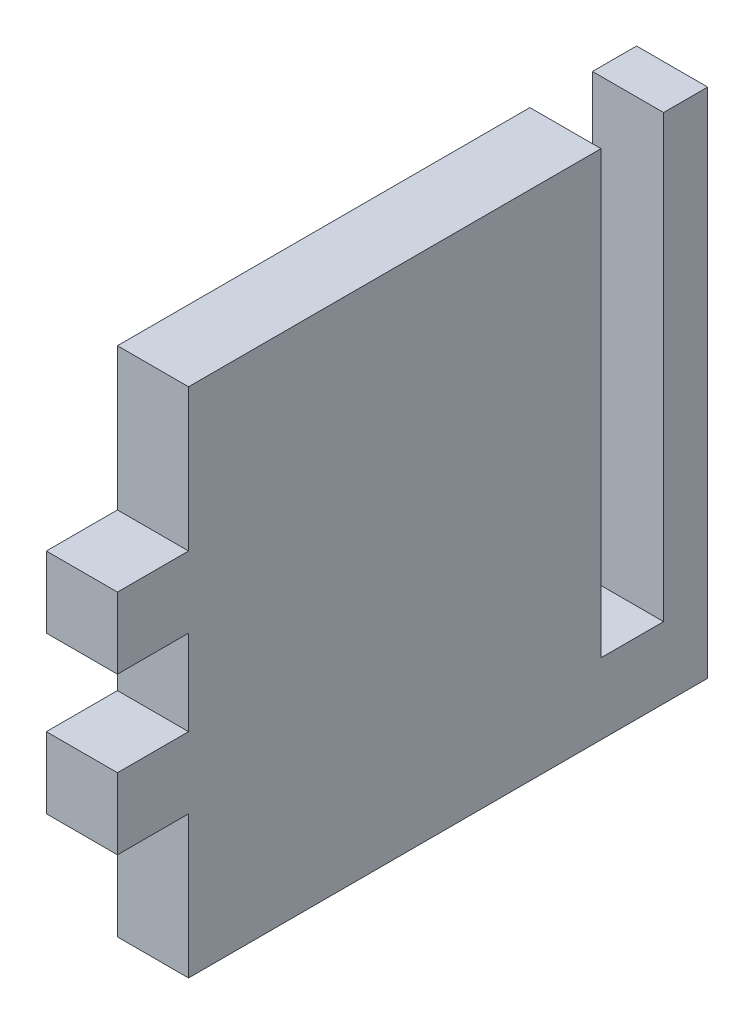
ISO-10303-21;
HEADER;
FILE_DESCRIPTION(('STEP AP214'),'2;1');
FILE_NAME('part.step','',(''),(''),'','','');
FILE_SCHEMA(('AUTOMOTIVE_DESIGN { 1 0 10303 214 1 1 1 1 }'));
ENDSEC;
DATA;
#1=APPLICATION_CONTEXT('core data for automotive mechanical design processes');
#2=APPLICATION_PROTOCOL_DEFINITION('international standard','automotive_design',2000,#1);
#3=PRODUCT_CONTEXT('',#1,'mechanical');
#4=PRODUCT('Part','Part','',(#3));
#5=PRODUCT_RELATED_PRODUCT_CATEGORY('part','',(#4));
#6=PRODUCT_DEFINITION_FORMATION('','',#4);
#7=PRODUCT_DEFINITION_CONTEXT('part definition',#1,'design');
#8=PRODUCT_DEFINITION('design','',#6,#7);
#9=PRODUCT_DEFINITION_SHAPE('','',#8);
#10=(LENGTH_UNIT() NAMED_UNIT(*) SI_UNIT(.MILLI.,.METRE.));
#11=(NAMED_UNIT(*) PLANE_ANGLE_UNIT() SI_UNIT($,.RADIAN.));
#12=(NAMED_UNIT(*) SI_UNIT($,.STERADIAN.) SOLID_ANGLE_UNIT());
#13=UNCERTAINTY_MEASURE_WITH_UNIT(LENGTH_MEASURE(1.E-05),#10,'distance_accuracy_value','');
#14=(GEOMETRIC_REPRESENTATION_CONTEXT(3) GLOBAL_UNCERTAINTY_ASSIGNED_CONTEXT((#13)) GLOBAL_UNIT_ASSIGNED_CONTEXT((#10,
#11,#12)) REPRESENTATION_CONTEXT('',''));
#15=CARTESIAN_POINT('',(0.,0.,0.));
#16=DIRECTION('',(0.,0.,1.));
#17=DIRECTION('',(1.,0.,0.));
#18=AXIS2_PLACEMENT_3D('',#15,#16,#17);
#19=CARTESIAN_POINT('',(6.35,45.72,0.));
#20=DIRECTION('',(0.,-1.,0.));
#21=DIRECTION('',(0.,0.,-1.));
#22=AXIS2_PLACEMENT_3D('',#19,#20,#21);
#23=PLANE('',#22);
#24=DIRECTION('',(0.,0.,1.));
#25=VECTOR('',#24,1.);
#26=CARTESIAN_POINT('',(6.35,45.72,0.));
#27=LINE('',#26,#25);
#28=CARTESIAN_POINT('',(6.35,45.72,-43.18));
#29=VERTEX_POINT('',#28);
#30=CARTESIAN_POINT('',(6.35,45.72,-6.35));
#31=VERTEX_POINT('',#30);
#32=EDGE_CURVE('E250',#29,#31,#27,.T.);
#33=ORIENTED_EDGE('',*,*,#32,.F.);
#34=DIRECTION('',(1.,0.,0.));
#35=VECTOR('',#34,1.);
#36=CARTESIAN_POINT('',(0.,45.72,-43.18));
#37=LINE('',#36,#35);
#38=CARTESIAN_POINT('',(0.,45.72,-43.18));
#39=VERTEX_POINT('',#38);
#40=EDGE_CURVE('E174',#39,#29,#37,.T.);
#41=ORIENTED_EDGE('',*,*,#40,.F.);
#42=DIRECTION('',(0.,0.,1.));
#43=VECTOR('',#42,1.);
#44=CARTESIAN_POINT('',(0.,45.72,0.));
#45=LINE('',#44,#43);
#46=CARTESIAN_POINT('',(0.,45.72,-6.35));
#47=VERTEX_POINT('',#46);
#48=EDGE_CURVE('E165',#39,#47,#45,.T.);
#49=ORIENTED_EDGE('',*,*,#48,.T.);
#50=DIRECTION('',(1.,0.,0.));
#51=VECTOR('',#50,1.);
#52=CARTESIAN_POINT('',(0.,45.72,-6.35));
#53=LINE('',#52,#51);
#54=EDGE_CURVE('E235',#47,#31,#53,.T.);
#55=ORIENTED_EDGE('',*,*,#54,.T.);
#56=EDGE_LOOP('',(#33,#41,#49,#55));
#57=FACE_BOUND('',#56,.T.);
#58=ADVANCED_FACE('F32',(#57),#23,.F.);
#59=CARTESIAN_POINT('',(6.35,0.,0.));
#60=DIRECTION('',(0.,0.,-1.));
#61=DIRECTION('',(-1.,0.,0.));
#62=AXIS2_PLACEMENT_3D('',#59,#60,#61);
#63=PLANE('',#62);
#64=DIRECTION('',(0.,-1.,0.));
#65=VECTOR('',#64,1.);
#66=CARTESIAN_POINT('',(0.,0.,0.));
#67=LINE('',#66,#65);
#68=CARTESIAN_POINT('',(0.,33.02,0.));
#69=VERTEX_POINT('',#68);
#70=CARTESIAN_POINT('',(0.,26.67,0.));
#71=VERTEX_POINT('',#70);
#72=EDGE_CURVE('E254',#69,#71,#67,.T.);
#73=ORIENTED_EDGE('',*,*,#72,.T.);
#74=DIRECTION('',(1.,0.,0.));
#75=VECTOR('',#74,1.);
#76=CARTESIAN_POINT('',(0.,26.67,0.));
#77=LINE('',#76,#75);
#78=CARTESIAN_POINT('',(6.35,26.67,0.));
#79=VERTEX_POINT('',#78);
#80=EDGE_CURVE('E196',#71,#79,#77,.T.);
#81=ORIENTED_EDGE('',*,*,#80,.T.);
#82=DIRECTION('',(0.,-1.,0.));
#83=VECTOR('',#82,1.);
#84=CARTESIAN_POINT('',(6.35,0.,0.));
#85=LINE('',#84,#83);
#86=CARTESIAN_POINT('',(6.35,33.02,0.));
#87=VERTEX_POINT('',#86);
#88=EDGE_CURVE('E242',#87,#79,#85,.T.);
#89=ORIENTED_EDGE('',*,*,#88,.F.);
#90=DIRECTION('',(1.,0.,0.));
#91=VECTOR('',#90,1.);
#92=CARTESIAN_POINT('',(0.,33.02,0.));
#93=LINE('',#92,#91);
#94=EDGE_CURVE('E230',#69,#87,#93,.T.);
#95=ORIENTED_EDGE('',*,*,#94,.F.);
#96=EDGE_LOOP('',(#73,#81,#89,#95));
#97=FACE_BOUND('',#96,.T.);
#98=ADVANCED_FACE('F305',(#97),#63,.F.);
#99=CARTESIAN_POINT('',(6.35,19.05,0.));
#100=VERTEX_POINT('',#99);
#101=CARTESIAN_POINT('',(6.35,12.7,0.));
#102=VERTEX_POINT('',#101);
#103=EDGE_CURVE('E246',#100,#102,#85,.T.);
#104=ORIENTED_EDGE('',*,*,#103,.F.);
#105=DIRECTION('',(1.,0.,0.));
#106=VECTOR('',#105,1.);
#107=CARTESIAN_POINT('',(0.,19.05,0.));
#108=LINE('',#107,#106);
#109=CARTESIAN_POINT('',(0.,19.05,0.));
#110=VERTEX_POINT('',#109);
#111=EDGE_CURVE('E189',#110,#100,#108,.T.);
#112=ORIENTED_EDGE('',*,*,#111,.F.);
#113=CARTESIAN_POINT('',(0.,12.7,0.));
#114=VERTEX_POINT('',#113);
#115=EDGE_CURVE('E238',#110,#114,#67,.T.);
#116=ORIENTED_EDGE('',*,*,#115,.T.);
#117=DIRECTION('',(1.,0.,0.));
#118=VECTOR('',#117,1.);
#119=CARTESIAN_POINT('',(0.,12.7,0.));
#120=LINE('',#119,#118);
#121=EDGE_CURVE('E217',#114,#102,#120,.T.);
#122=ORIENTED_EDGE('',*,*,#121,.T.);
#123=EDGE_LOOP('',(#104,#112,#116,#122));
#124=FACE_BOUND('',#123,.T.);
#125=ADVANCED_FACE('F34',(#124),#63,.F.);
#126=CARTESIAN_POINT('',(6.35,0.,0.));
#127=DIRECTION('',(0.,1.,0.));
#128=DIRECTION('',(0.,0.,1.));
#129=AXIS2_PLACEMENT_3D('',#126,#127,#128);
#130=PLANE('',#129);
#131=DIRECTION('',(0.,0.,-1.));
#132=VECTOR('',#131,1.);
#133=CARTESIAN_POINT('',(6.35,0.,0.));
#134=LINE('',#133,#132);
#135=CARTESIAN_POINT('',(6.35,0.,-6.35));
#136=VERTEX_POINT('',#135);
#137=CARTESIAN_POINT('',(6.35,0.,-52.705));
#138=VERTEX_POINT('',#137);
#139=EDGE_CURVE('E245',#136,#138,#134,.T.);
#140=ORIENTED_EDGE('',*,*,#139,.F.);
#141=DIRECTION('',(1.,0.,0.));
#142=VECTOR('',#141,1.);
#143=CARTESIAN_POINT('',(0.,0.,-6.35));
#144=LINE('',#143,#142);
#145=CARTESIAN_POINT('',(0.,0.,-6.35));
#146=VERTEX_POINT('',#145);
#147=EDGE_CURVE('E212',#146,#136,#144,.T.);
#148=ORIENTED_EDGE('',*,*,#147,.F.);
#149=DIRECTION('',(0.,0.,-1.));
#150=VECTOR('',#149,1.);
#151=CARTESIAN_POINT('',(0.,0.,0.));
#152=LINE('',#151,#150);
#153=CARTESIAN_POINT('',(0.,0.,-52.705));
#154=VERTEX_POINT('',#153);
#155=EDGE_CURVE('E257',#146,#154,#152,.T.);
#156=ORIENTED_EDGE('',*,*,#155,.T.);
#157=DIRECTION('',(-1.,0.,0.));
#158=VECTOR('',#157,1.);
#159=CARTESIAN_POINT('',(6.35,0.,-52.705));
#160=LINE('',#159,#158);
#161=EDGE_CURVE('E11',#138,#154,#160,.T.);
#162=ORIENTED_EDGE('',*,*,#161,.F.);
#163=EDGE_LOOP('',(#140,#148,#156,#162));
#164=FACE_BOUND('',#163,.T.);
#165=ADVANCED_FACE('F277',(#164),#130,.F.);
#166=CARTESIAN_POINT('',(6.35,0.,-52.705));
#167=DIRECTION('',(0.,0.,1.));
#168=DIRECTION('',(1.,0.,0.));
#169=AXIS2_PLACEMENT_3D('',#166,#167,#168);
#170=PLANE('',#169);
#171=DIRECTION('',(0.,1.,0.));
#172=VECTOR('',#171,1.);
#173=CARTESIAN_POINT('',(0.,0.,-52.705));
#174=LINE('',#173,#172);
#175=CARTESIAN_POINT('',(0.,45.72,-52.705));
#176=VERTEX_POINT('',#175);
#177=EDGE_CURVE('E259',#154,#176,#174,.T.);
#178=ORIENTED_EDGE('',*,*,#177,.T.);
#179=DIRECTION('',(-1.,0.,0.));
#180=VECTOR('',#179,1.);
#181=CARTESIAN_POINT('',(6.35,45.72,-52.705));
#182=LINE('',#181,#180);
#183=CARTESIAN_POINT('',(6.35,45.72,-52.705));
#184=VERTEX_POINT('',#183);
#185=EDGE_CURVE('E40',#184,#176,#182,.T.);
#186=ORIENTED_EDGE('',*,*,#185,.F.);
#187=DIRECTION('',(0.,1.,0.));
#188=VECTOR('',#187,1.);
#189=CARTESIAN_POINT('',(6.35,0.,-52.705));
#190=LINE('',#189,#188);
#191=EDGE_CURVE('E248',#138,#184,#190,.T.);
#192=ORIENTED_EDGE('',*,*,#191,.F.);
#193=ORIENTED_EDGE('',*,*,#161,.T.);
#194=EDGE_LOOP('',(#178,#186,#192,#193));
#195=FACE_BOUND('',#194,.T.);
#196=ADVANCED_FACE('F273',(#195),#170,.F.);
#197=CARTESIAN_POINT('',(0.,45.72,-48.768));
#198=VERTEX_POINT('',#197);
#199=EDGE_CURVE('E261',#176,#198,#45,.T.);
#200=ORIENTED_EDGE('',*,*,#199,.T.);
#201=DIRECTION('',(1.,0.,0.));
#202=VECTOR('',#201,1.);
#203=CARTESIAN_POINT('',(0.,45.72,-48.768));
#204=LINE('',#203,#202);
#205=CARTESIAN_POINT('',(6.35,45.72,-48.768));
#206=VERTEX_POINT('',#205);
#207=EDGE_CURVE('E177',#198,#206,#204,.T.);
#208=ORIENTED_EDGE('',*,*,#207,.T.);
#209=EDGE_CURVE('E251',#184,#206,#27,.T.);
#210=ORIENTED_EDGE('',*,*,#209,.F.);
#211=ORIENTED_EDGE('',*,*,#185,.T.);
#212=EDGE_LOOP('',(#200,#208,#210,#211));
#213=FACE_BOUND('',#212,.T.);
#214=ADVANCED_FACE('F268',(#213),#23,.F.);
#215=CARTESIAN_POINT('',(6.35,0.,0.));
#216=DIRECTION('',(-1.,0.,0.));
#217=DIRECTION('',(0.,0.,1.));
#218=AXIS2_PLACEMENT_3D('',#215,#216,#217);
#219=PLANE('',#218);
#220=DIRECTION('',(0.,0.,-1.));
#221=VECTOR('',#220,1.);
#222=CARTESIAN_POINT('',(6.35,6.35,-43.18));
#223=LINE('',#222,#221);
#224=CARTESIAN_POINT('',(6.35,6.35,-43.18));
#225=VERTEX_POINT('',#224);
#226=CARTESIAN_POINT('',(6.35,6.35,-48.768));
#227=VERTEX_POINT('',#226);
#228=EDGE_CURVE('E168',#225,#227,#223,.T.);
#229=ORIENTED_EDGE('',*,*,#228,.F.);
#230=DIRECTION('',(0.,-1.,0.));
#231=VECTOR('',#230,1.);
#232=CARTESIAN_POINT('',(6.35,45.72,-43.18));
#233=LINE('',#232,#231);
#234=EDGE_CURVE('E151',#29,#225,#233,.T.);
#235=ORIENTED_EDGE('',*,*,#234,.F.);
#236=ORIENTED_EDGE('',*,*,#32,.T.);
#237=DIRECTION('',(0.,1.,0.));
#238=VECTOR('',#237,1.);
#239=CARTESIAN_POINT('',(6.35,45.72,-6.35));
#240=LINE('',#239,#238);
#241=CARTESIAN_POINT('',(6.35,33.02,-6.35));
#242=VERTEX_POINT('',#241);
#243=EDGE_CURVE('E228',#242,#31,#240,.T.);
#244=ORIENTED_EDGE('',*,*,#243,.F.);
#245=DIRECTION('',(0.,0.,-1.));
#246=VECTOR('',#245,1.);
#247=CARTESIAN_POINT('',(6.35,33.02,0.));
#248=LINE('',#247,#246);
#249=EDGE_CURVE('E220',#87,#242,#248,.T.);
#250=ORIENTED_EDGE('',*,*,#249,.F.);
#251=ORIENTED_EDGE('',*,*,#88,.T.);
#252=DIRECTION('',(0.,0.,1.));
#253=VECTOR('',#252,1.);
#254=CARTESIAN_POINT('',(6.35,26.67,0.));
#255=LINE('',#254,#253);
#256=CARTESIAN_POINT('',(6.35,26.67,-6.35));
#257=VERTEX_POINT('',#256);
#258=EDGE_CURVE('E184',#257,#79,#255,.T.);
#259=ORIENTED_EDGE('',*,*,#258,.F.);
#260=DIRECTION('',(0.,1.,0.));
#261=VECTOR('',#260,1.);
#262=CARTESIAN_POINT('',(6.35,26.67,-6.35));
#263=LINE('',#262,#261);
#264=CARTESIAN_POINT('',(6.35,19.05,-6.35));
#265=VERTEX_POINT('',#264);
#266=EDGE_CURVE('E192',#265,#257,#263,.T.);
#267=ORIENTED_EDGE('',*,*,#266,.F.);
#268=DIRECTION('',(0.,0.,-1.));
#269=VECTOR('',#268,1.);
#270=CARTESIAN_POINT('',(6.35,19.05,0.));
#271=LINE('',#270,#269);
#272=EDGE_CURVE('E176',#100,#265,#271,.T.);
#273=ORIENTED_EDGE('',*,*,#272,.F.);
#274=ORIENTED_EDGE('',*,*,#103,.T.);
#275=DIRECTION('',(0.,0.,1.));
#276=VECTOR('',#275,1.);
#277=CARTESIAN_POINT('',(6.35,12.7,0.));
#278=LINE('',#277,#276);
#279=CARTESIAN_POINT('',(6.35,12.7,-6.35));
#280=VERTEX_POINT('',#279);
#281=EDGE_CURVE('E209',#280,#102,#278,.T.);
#282=ORIENTED_EDGE('',*,*,#281,.F.);
#283=DIRECTION('',(0.,1.,0.));
#284=VECTOR('',#283,1.);
#285=CARTESIAN_POINT('',(6.35,12.7,-6.35));
#286=LINE('',#285,#284);
#287=EDGE_CURVE('E199',#136,#280,#286,.T.);
#288=ORIENTED_EDGE('',*,*,#287,.F.);
#289=ORIENTED_EDGE('',*,*,#139,.T.);
#290=ORIENTED_EDGE('',*,*,#191,.T.);
#291=ORIENTED_EDGE('',*,*,#209,.T.);
#292=DIRECTION('',(0.,1.,0.));
#293=VECTOR('',#292,1.);
#294=CARTESIAN_POINT('',(6.35,45.72,-48.768));
#295=LINE('',#294,#293);
#296=EDGE_CURVE('E166',#227,#206,#295,.T.);
#297=ORIENTED_EDGE('',*,*,#296,.F.);
#298=EDGE_LOOP('',(#229,#235,#236,#244,#250,#251,#259,#267,#273,#274,#282,#288,#289,#290,#291,#297));
#299=FACE_BOUND('',#298,.T.);
#300=ADVANCED_FACE('F285',(#299),#219,.F.);
#301=CARTESIAN_POINT('',(0.,0.,0.));
#302=DIRECTION('',(-1.,0.,0.));
#303=DIRECTION('',(0.,0.,1.));
#304=AXIS2_PLACEMENT_3D('',#301,#302,#303);
#305=PLANE('',#304);
#306=DIRECTION('',(0.,-1.,0.));
#307=VECTOR('',#306,1.);
#308=CARTESIAN_POINT('',(0.,45.72,-43.18));
#309=LINE('',#308,#307);
#310=CARTESIAN_POINT('',(0.,6.35,-43.18));
#311=VERTEX_POINT('',#310);
#312=EDGE_CURVE('E148',#39,#311,#309,.T.);
#313=ORIENTED_EDGE('',*,*,#312,.T.);
#314=DIRECTION('',(0.,0.,-1.));
#315=VECTOR('',#314,1.);
#316=CARTESIAN_POINT('',(0.,6.35,-43.18));
#317=LINE('',#316,#315);
#318=CARTESIAN_POINT('',(0.,6.35,-48.768));
#319=VERTEX_POINT('',#318);
#320=EDGE_CURVE('E158',#311,#319,#317,.T.);
#321=ORIENTED_EDGE('',*,*,#320,.T.);
#322=DIRECTION('',(0.,1.,0.));
#323=VECTOR('',#322,1.);
#324=CARTESIAN_POINT('',(0.,45.72,-48.768));
#325=LINE('',#324,#323);
#326=EDGE_CURVE('E47',#319,#198,#325,.T.);
#327=ORIENTED_EDGE('',*,*,#326,.T.);
#328=ORIENTED_EDGE('',*,*,#199,.F.);
#329=ORIENTED_EDGE('',*,*,#177,.F.);
#330=ORIENTED_EDGE('',*,*,#155,.F.);
#331=DIRECTION('',(0.,1.,0.));
#332=VECTOR('',#331,1.);
#333=CARTESIAN_POINT('',(0.,12.7,-6.35));
#334=LINE('',#333,#332);
#335=CARTESIAN_POINT('',(0.,12.7,-6.35));
#336=VERTEX_POINT('',#335);
#337=EDGE_CURVE('E205',#146,#336,#334,.T.);
#338=ORIENTED_EDGE('',*,*,#337,.T.);
#339=DIRECTION('',(0.,0.,1.));
#340=VECTOR('',#339,1.);
#341=CARTESIAN_POINT('',(0.,12.7,0.));
#342=LINE('',#341,#340);
#343=EDGE_CURVE('E208',#336,#114,#342,.T.);
#344=ORIENTED_EDGE('',*,*,#343,.T.);
#345=ORIENTED_EDGE('',*,*,#115,.F.);
#346=DIRECTION('',(0.,0.,-1.));
#347=VECTOR('',#346,1.);
#348=CARTESIAN_POINT('',(0.,19.05,0.));
#349=LINE('',#348,#347);
#350=CARTESIAN_POINT('',(0.,19.05,-6.35));
#351=VERTEX_POINT('',#350);
#352=EDGE_CURVE('E181',#110,#351,#349,.T.);
#353=ORIENTED_EDGE('',*,*,#352,.T.);
#354=DIRECTION('',(0.,1.,0.));
#355=VECTOR('',#354,1.);
#356=CARTESIAN_POINT('',(0.,26.67,-6.35));
#357=LINE('',#356,#355);
#358=CARTESIAN_POINT('',(0.,26.67,-6.35));
#359=VERTEX_POINT('',#358);
#360=EDGE_CURVE('E55',#351,#359,#357,.T.);
#361=ORIENTED_EDGE('',*,*,#360,.T.);
#362=DIRECTION('',(0.,0.,1.));
#363=VECTOR('',#362,1.);
#364=CARTESIAN_POINT('',(0.,26.67,0.));
#365=LINE('',#364,#363);
#366=EDGE_CURVE('E186',#359,#71,#365,.T.);
#367=ORIENTED_EDGE('',*,*,#366,.T.);
#368=ORIENTED_EDGE('',*,*,#72,.F.);
#369=DIRECTION('',(0.,0.,-1.));
#370=VECTOR('',#369,1.);
#371=CARTESIAN_POINT('',(0.,33.02,0.));
#372=LINE('',#371,#370);
#373=CARTESIAN_POINT('',(0.,33.02,-6.35));
#374=VERTEX_POINT('',#373);
#375=EDGE_CURVE('E224',#69,#374,#372,.T.);
#376=ORIENTED_EDGE('',*,*,#375,.T.);
#377=DIRECTION('',(0.,1.,0.));
#378=VECTOR('',#377,1.);
#379=CARTESIAN_POINT('',(0.,45.72,-6.35));
#380=LINE('',#379,#378);
#381=EDGE_CURVE('E227',#374,#47,#380,.T.);
#382=ORIENTED_EDGE('',*,*,#381,.T.);
#383=ORIENTED_EDGE('',*,*,#48,.F.);
#384=EDGE_LOOP('',(#313,#321,#327,#328,#329,#330,#338,#344,#345,#353,#361,#367,#368,#376,#382,#383));
#385=FACE_BOUND('',#384,.T.);
#386=ADVANCED_FACE('F163',(#385),#305,.T.);
#387=CARTESIAN_POINT('',(0.,45.72,-6.35));
#388=DIRECTION('',(0.,0.,-1.));
#389=DIRECTION('',(0.,1.,0.));
#390=AXIS2_PLACEMENT_3D('',#387,#388,#389);
#391=PLANE('',#390);
#392=ORIENTED_EDGE('',*,*,#243,.T.);
#393=ORIENTED_EDGE('',*,*,#54,.F.);
#394=ORIENTED_EDGE('',*,*,#381,.F.);
#395=DIRECTION('',(1.,0.,0.));
#396=VECTOR('',#395,1.);
#397=CARTESIAN_POINT('',(0.,33.02,-6.35));
#398=LINE('',#397,#396);
#399=EDGE_CURVE('E239',#374,#242,#398,.T.);
#400=ORIENTED_EDGE('',*,*,#399,.T.);
#401=EDGE_LOOP('',(#392,#393,#394,#400));
#402=FACE_BOUND('',#401,.T.);
#403=ADVANCED_FACE('F313',(#402),#391,.F.);
#404=CARTESIAN_POINT('',(0.,33.02,0.));
#405=DIRECTION('',(0.,-1.,0.));
#406=DIRECTION('',(0.,0.,-1.));
#407=AXIS2_PLACEMENT_3D('',#404,#405,#406);
#408=PLANE('',#407);
#409=ORIENTED_EDGE('',*,*,#249,.T.);
#410=ORIENTED_EDGE('',*,*,#399,.F.);
#411=ORIENTED_EDGE('',*,*,#375,.F.);
#412=ORIENTED_EDGE('',*,*,#94,.T.);
#413=EDGE_LOOP('',(#409,#410,#411,#412));
#414=FACE_BOUND('',#413,.T.);
#415=ADVANCED_FACE('F310',(#414),#408,.F.);
#416=CARTESIAN_POINT('',(0.,12.7,0.));
#417=DIRECTION('',(0.,1.,0.));
#418=DIRECTION('',(0.,0.,1.));
#419=AXIS2_PLACEMENT_3D('',#416,#417,#418);
#420=PLANE('',#419);
#421=ORIENTED_EDGE('',*,*,#281,.T.);
#422=ORIENTED_EDGE('',*,*,#121,.F.);
#423=ORIENTED_EDGE('',*,*,#343,.F.);
#424=DIRECTION('',(1.,0.,0.));
#425=VECTOR('',#424,1.);
#426=CARTESIAN_POINT('',(0.,12.7,-6.35));
#427=LINE('',#426,#425);
#428=EDGE_CURVE('E221',#336,#280,#427,.T.);
#429=ORIENTED_EDGE('',*,*,#428,.T.);
#430=EDGE_LOOP('',(#421,#422,#423,#429));
#431=FACE_BOUND('',#430,.T.);
#432=ADVANCED_FACE('F290',(#431),#420,.F.);
#433=CARTESIAN_POINT('',(0.,12.7,-6.35));
#434=DIRECTION('',(0.,0.,-1.));
#435=DIRECTION('',(0.,1.,0.));
#436=AXIS2_PLACEMENT_3D('',#433,#434,#435);
#437=PLANE('',#436);
#438=ORIENTED_EDGE('',*,*,#287,.T.);
#439=ORIENTED_EDGE('',*,*,#428,.F.);
#440=ORIENTED_EDGE('',*,*,#337,.F.);
#441=ORIENTED_EDGE('',*,*,#147,.T.);
#442=EDGE_LOOP('',(#438,#439,#440,#441));
#443=FACE_BOUND('',#442,.T.);
#444=ADVANCED_FACE('F281',(#443),#437,.F.);
#445=CARTESIAN_POINT('',(0.,26.67,0.));
#446=DIRECTION('',(0.,1.,0.));
#447=DIRECTION('',(0.,0.,1.));
#448=AXIS2_PLACEMENT_3D('',#445,#446,#447);
#449=PLANE('',#448);
#450=ORIENTED_EDGE('',*,*,#258,.T.);
#451=ORIENTED_EDGE('',*,*,#80,.F.);
#452=ORIENTED_EDGE('',*,*,#366,.F.);
#453=DIRECTION('',(1.,0.,0.));
#454=VECTOR('',#453,1.);
#455=CARTESIAN_POINT('',(0.,26.67,-6.35));
#456=LINE('',#455,#454);
#457=EDGE_CURVE('E200',#359,#257,#456,.T.);
#458=ORIENTED_EDGE('',*,*,#457,.T.);
#459=EDGE_LOOP('',(#450,#451,#452,#458));
#460=FACE_BOUND('',#459,.T.);
#461=ADVANCED_FACE('F303',(#460),#449,.F.);
#462=CARTESIAN_POINT('',(0.,26.67,-6.35));
#463=DIRECTION('',(0.,0.,-1.));
#464=DIRECTION('',(0.,1.,0.));
#465=AXIS2_PLACEMENT_3D('',#462,#463,#464);
#466=PLANE('',#465);
#467=ORIENTED_EDGE('',*,*,#266,.T.);
#468=ORIENTED_EDGE('',*,*,#457,.F.);
#469=ORIENTED_EDGE('',*,*,#360,.F.);
#470=DIRECTION('',(1.,0.,0.));
#471=VECTOR('',#470,1.);
#472=CARTESIAN_POINT('',(0.,19.05,-6.35));
#473=LINE('',#472,#471);
#474=EDGE_CURVE('E202',#351,#265,#473,.T.);
#475=ORIENTED_EDGE('',*,*,#474,.T.);
#476=EDGE_LOOP('',(#467,#468,#469,#475));
#477=FACE_BOUND('',#476,.T.);
#478=ADVANCED_FACE('F297',(#477),#466,.F.);
#479=CARTESIAN_POINT('',(0.,19.05,0.));
#480=DIRECTION('',(0.,-1.,0.));
#481=DIRECTION('',(0.,0.,-1.));
#482=AXIS2_PLACEMENT_3D('',#479,#480,#481);
#483=PLANE('',#482);
#484=ORIENTED_EDGE('',*,*,#272,.T.);
#485=ORIENTED_EDGE('',*,*,#474,.F.);
#486=ORIENTED_EDGE('',*,*,#352,.F.);
#487=ORIENTED_EDGE('',*,*,#111,.T.);
#488=EDGE_LOOP('',(#484,#485,#486,#487));
#489=FACE_BOUND('',#488,.T.);
#490=ADVANCED_FACE('F295',(#489),#483,.F.);
#491=CARTESIAN_POINT('',(0.,45.72,-43.18));
#492=DIRECTION('',(0.,0.,1.));
#493=DIRECTION('',(0.,-1.,0.));
#494=AXIS2_PLACEMENT_3D('',#491,#492,#493);
#495=PLANE('',#494);
#496=ORIENTED_EDGE('',*,*,#234,.T.);
#497=DIRECTION('',(1.,0.,0.));
#498=VECTOR('',#497,1.);
#499=CARTESIAN_POINT('',(0.,6.35,-43.18));
#500=LINE('',#499,#498);
#501=EDGE_CURVE('E144',#311,#225,#500,.T.);
#502=ORIENTED_EDGE('',*,*,#501,.F.);
#503=ORIENTED_EDGE('',*,*,#312,.F.);
#504=ORIENTED_EDGE('',*,*,#40,.T.);
#505=EDGE_LOOP('',(#496,#502,#503,#504));
#506=FACE_BOUND('',#505,.T.);
#507=ADVANCED_FACE('F146',(#506),#495,.F.);
#508=CARTESIAN_POINT('',(0.,45.72,-48.768));
#509=DIRECTION('',(0.,0.,-1.));
#510=DIRECTION('',(0.,1.,0.));
#511=AXIS2_PLACEMENT_3D('',#508,#509,#510);
#512=PLANE('',#511);
#513=ORIENTED_EDGE('',*,*,#296,.T.);
#514=ORIENTED_EDGE('',*,*,#207,.F.);
#515=ORIENTED_EDGE('',*,*,#326,.F.);
#516=DIRECTION('',(1.,0.,0.));
#517=VECTOR('',#516,1.);
#518=CARTESIAN_POINT('',(0.,6.35,-48.768));
#519=LINE('',#518,#517);
#520=EDGE_CURVE('E155',#319,#227,#519,.T.);
#521=ORIENTED_EDGE('',*,*,#520,.T.);
#522=EDGE_LOOP('',(#513,#514,#515,#521));
#523=FACE_BOUND('',#522,.T.);
#524=ADVANCED_FACE('F318',(#523),#512,.F.);
#525=CARTESIAN_POINT('',(0.,6.35,-43.18));
#526=DIRECTION('',(0.,-1.,0.));
#527=DIRECTION('',(0.,0.,-1.));
#528=AXIS2_PLACEMENT_3D('',#525,#526,#527);
#529=PLANE('',#528);
#530=ORIENTED_EDGE('',*,*,#228,.T.);
#531=ORIENTED_EDGE('',*,*,#520,.F.);
#532=ORIENTED_EDGE('',*,*,#320,.F.);
#533=ORIENTED_EDGE('',*,*,#501,.T.);
#534=EDGE_LOOP('',(#530,#531,#532,#533));
#535=FACE_BOUND('',#534,.T.);
#536=ADVANCED_FACE('F159',(#535),#529,.F.);
#537=CLOSED_SHELL('',(#58,#98,#125,#165,#196,#214,#300,#386,#403,#415,#432,#444,#461,#478,#490,
#507,#524,#536));
#538=MANIFOLD_SOLID_BREP('B2',#537);
#539=ADVANCED_BREP_SHAPE_REPRESENTATION('',(#18,#538),#14);
#540=SHAPE_DEFINITION_REPRESENTATION(#9,#539);
ENDSEC;
END-ISO-10303-21;
